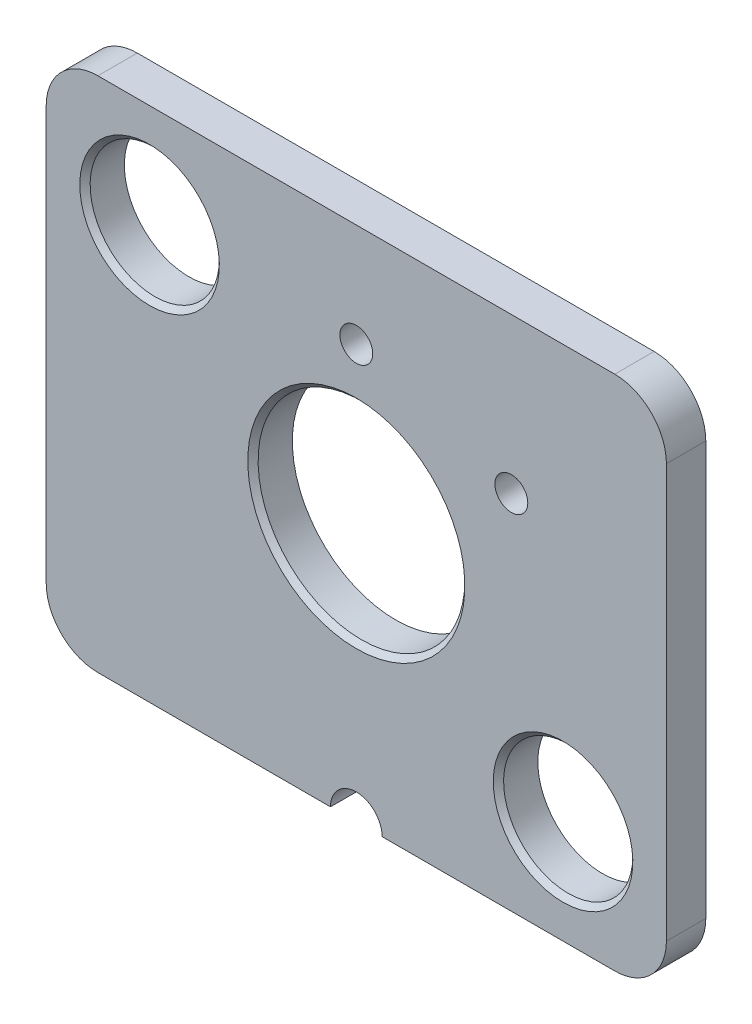
ISO-10303-21;
HEADER;
FILE_DESCRIPTION(('STEP AP214'),'2;1');
FILE_NAME('part.step','',(''),(''),'','','');
FILE_SCHEMA(('AUTOMOTIVE_DESIGN { 1 0 10303 214 1 1 1 1 }'));
ENDSEC;
DATA;
#1=APPLICATION_CONTEXT('core data for automotive mechanical design processes');
#2=APPLICATION_PROTOCOL_DEFINITION('international standard','automotive_design',2000,#1);
#3=PRODUCT_CONTEXT('',#1,'mechanical');
#4=PRODUCT('Part','Part','',(#3));
#5=PRODUCT_RELATED_PRODUCT_CATEGORY('part','',(#4));
#6=PRODUCT_DEFINITION_FORMATION('','',#4);
#7=PRODUCT_DEFINITION_CONTEXT('part definition',#1,'design');
#8=PRODUCT_DEFINITION('design','',#6,#7);
#9=PRODUCT_DEFINITION_SHAPE('','',#8);
#10=(LENGTH_UNIT() NAMED_UNIT(*) SI_UNIT(.MILLI.,.METRE.));
#11=(NAMED_UNIT(*) PLANE_ANGLE_UNIT() SI_UNIT($,.RADIAN.));
#12=(NAMED_UNIT(*) SI_UNIT($,.STERADIAN.) SOLID_ANGLE_UNIT());
#13=UNCERTAINTY_MEASURE_WITH_UNIT(LENGTH_MEASURE(1.E-05),#10,'distance_accuracy_value','');
#14=(GEOMETRIC_REPRESENTATION_CONTEXT(3) GLOBAL_UNCERTAINTY_ASSIGNED_CONTEXT((#13)) GLOBAL_UNIT_ASSIGNED_CONTEXT((#10,
#11,#12)) REPRESENTATION_CONTEXT('',''));
#15=CARTESIAN_POINT('',(0.,0.,0.));
#16=DIRECTION('',(0.,0.,1.));
#17=DIRECTION('',(1.,0.,0.));
#18=AXIS2_PLACEMENT_3D('',#15,#16,#17);
#19=CARTESIAN_POINT('',(10.,-8.,0.));
#20=DIRECTION('',(0.,0.,1.));
#21=DIRECTION('',(1.,0.,0.));
#22=AXIS2_PLACEMENT_3D('',#19,#20,#21);
#23=CYLINDRICAL_SURFACE('',#22,1.25);
#24=CARTESIAN_POINT('',(10.,-8.,0.));
#25=DIRECTION('',(0.,0.,1.));
#26=DIRECTION('',(1.,0.,0.));
#27=AXIS2_PLACEMENT_3D('',#24,#25,#26);
#28=CIRCLE('',#27,1.25);
#29=CARTESIAN_POINT('',(11.25,-8.,0.));
#30=VERTEX_POINT('',#29);
#31=EDGE_CURVE('E21',#30,#30,#28,.F.);
#32=ORIENTED_EDGE('',*,*,#31,.T.);
#33=EDGE_LOOP('',(#32));
#34=FACE_BOUND('',#33,.T.);
#35=CARTESIAN_POINT('',(10.,-8.,0.662000000000051));
#36=DIRECTION('',(0.,0.,1.));
#37=DIRECTION('',(1.,0.,0.));
#38=AXIS2_PLACEMENT_3D('',#35,#36,#37);
#39=CIRCLE('',#38,1.25);
#40=CARTESIAN_POINT('',(11.25,-8.,0.662));
#41=VERTEX_POINT('',#40);
#42=EDGE_CURVE('E112',#41,#41,#39,.F.);
#43=ORIENTED_EDGE('',*,*,#42,.F.);
#44=EDGE_LOOP('',(#43));
#45=FACE_BOUND('',#44,.T.);
#46=ADVANCED_FACE('F17',(#34,#45),#23,.F.);
#47=CARTESIAN_POINT('',(2.,-2.,0.));
#48=DIRECTION('',(0.,0.,1.));
#49=DIRECTION('',(1.,0.,0.));
#50=AXIS2_PLACEMENT_3D('',#47,#48,#49);
#51=CYLINDRICAL_SURFACE('',#50,1.25);
#52=CARTESIAN_POINT('',(2.,-2.,0.));
#53=DIRECTION('',(0.,0.,1.));
#54=DIRECTION('',(1.,0.,0.));
#55=AXIS2_PLACEMENT_3D('',#52,#53,#54);
#56=CIRCLE('',#55,1.25);
#57=CARTESIAN_POINT('',(3.25,-2.,0.));
#58=VERTEX_POINT('',#57);
#59=EDGE_CURVE('E104',#58,#58,#56,.F.);
#60=ORIENTED_EDGE('',*,*,#59,.T.);
#61=EDGE_LOOP('',(#60));
#62=FACE_BOUND('',#61,.T.);
#63=CARTESIAN_POINT('',(2.,-2.,0.662000000000051));
#64=DIRECTION('',(0.,0.,1.));
#65=DIRECTION('',(1.,0.,0.));
#66=AXIS2_PLACEMENT_3D('',#63,#64,#65);
#67=CIRCLE('',#66,1.25);
#68=CARTESIAN_POINT('',(3.25,-2.,0.662));
#69=VERTEX_POINT('',#68);
#70=EDGE_CURVE('E154',#69,#69,#67,.F.);
#71=ORIENTED_EDGE('',*,*,#70,.F.);
#72=EDGE_LOOP('',(#71));
#73=FACE_BOUND('',#72,.T.);
#74=ADVANCED_FACE('F214',(#62,#73),#51,.F.);
#75=CARTESIAN_POINT('',(0.,-10.,0.));
#76=DIRECTION('',(0.,0.,1.));
#77=DIRECTION('',(1.,0.,0.));
#78=AXIS2_PLACEMENT_3D('',#75,#76,#77);
#79=PLANE('',#78);
#80=CARTESIAN_POINT('',(6.,-5.,0.));
#81=DIRECTION('',(0.,0.,1.));
#82=DIRECTION('',(1.,0.,0.));
#83=AXIS2_PLACEMENT_3D('',#80,#81,#82);
#84=CIRCLE('',#83,2.);
#85=CARTESIAN_POINT('',(8.,-5.,0.));
#86=VERTEX_POINT('',#85);
#87=EDGE_CURVE('E191',#86,#86,#84,.F.);
#88=ORIENTED_EDGE('',*,*,#87,.F.);
#89=EDGE_LOOP('',(#88));
#90=FACE_BOUND('',#89,.T.);
#91=ORIENTED_EDGE('',*,*,#59,.F.);
#92=EDGE_LOOP('',(#91));
#93=FACE_BOUND('',#92,.T.);
#94=ORIENTED_EDGE('',*,*,#31,.F.);
#95=EDGE_LOOP('',(#94));
#96=FACE_BOUND('',#95,.T.);
#97=CARTESIAN_POINT('',(6.,-2.,0.));
#98=DIRECTION('',(0.,0.,1.));
#99=DIRECTION('',(1.,0.,0.));
#100=AXIS2_PLACEMENT_3D('',#97,#98,#99);
#101=CIRCLE('',#100,0.317499999999999);
#102=CARTESIAN_POINT('',(6.3175,-2.,0.));
#103=VERTEX_POINT('',#102);
#104=EDGE_CURVE('E194',#103,#103,#101,.F.);
#105=ORIENTED_EDGE('',*,*,#104,.F.);
#106=EDGE_LOOP('',(#105));
#107=FACE_BOUND('',#106,.T.);
#108=CARTESIAN_POINT('',(9.,-3.,0.));
#109=DIRECTION('',(0.,0.,1.));
#110=DIRECTION('',(1.,0.,0.));
#111=AXIS2_PLACEMENT_3D('',#108,#109,#110);
#112=CIRCLE('',#111,0.3175);
#113=CARTESIAN_POINT('',(9.3175,-3.,0.));
#114=VERTEX_POINT('',#113);
#115=EDGE_CURVE('E157',#114,#114,#112,.F.);
#116=ORIENTED_EDGE('',*,*,#115,.F.);
#117=EDGE_LOOP('',(#116));
#118=FACE_BOUND('',#117,.T.);
#119=CARTESIAN_POINT('',(6.,-10.,0.));
#120=DIRECTION('',(0.,0.,1.));
#121=DIRECTION('',(1.,0.,0.));
#122=AXIS2_PLACEMENT_3D('',#119,#120,#121);
#123=CIRCLE('',#122,0.5);
#124=CARTESIAN_POINT('',(5.5,-10.,0.));
#125=VERTEX_POINT('',#124);
#126=CARTESIAN_POINT('',(6.5,-10.,0.));
#127=VERTEX_POINT('',#126);
#128=EDGE_CURVE('E93',#125,#127,#123,.F.);
#129=ORIENTED_EDGE('',*,*,#128,.F.);
#130=DIRECTION('',(-1.,0.,0.));
#131=VECTOR('',#130,1.);
#132=CARTESIAN_POINT('',(3.25,-10.,0.));
#133=LINE('',#132,#131);
#134=CARTESIAN_POINT('',(1.,-10.,0.));
#135=VERTEX_POINT('',#134);
#136=EDGE_CURVE('E97',#125,#135,#133,.T.);
#137=ORIENTED_EDGE('',*,*,#136,.T.);
#138=CARTESIAN_POINT('',(1.,-9.,0.));
#139=DIRECTION('',(0.,0.,-1.));
#140=DIRECTION('',(0.,1.,0.));
#141=AXIS2_PLACEMENT_3D('',#138,#139,#140);
#142=CIRCLE('',#141,1.);
#143=CARTESIAN_POINT('',(0.,-9.00000000008979,0.));
#144=VERTEX_POINT('',#143);
#145=EDGE_CURVE('E124',#135,#144,#142,.T.);
#146=ORIENTED_EDGE('',*,*,#145,.T.);
#147=DIRECTION('',(0.,1.,0.));
#148=VECTOR('',#147,1.);
#149=CARTESIAN_POINT('',(0.,-5.,0.));
#150=LINE('',#149,#148);
#151=CARTESIAN_POINT('',(0.,-1.,0.));
#152=VERTEX_POINT('',#151);
#153=EDGE_CURVE('E128',#144,#152,#150,.T.);
#154=ORIENTED_EDGE('',*,*,#153,.T.);
#155=CARTESIAN_POINT('',(1.,-1.,0.));
#156=DIRECTION('',(0.,0.,-1.));
#157=DIRECTION('',(0.,1.,0.));
#158=AXIS2_PLACEMENT_3D('',#155,#156,#157);
#159=CIRCLE('',#158,1.);
#160=CARTESIAN_POINT('',(1.00000000010255,0.,0.));
#161=VERTEX_POINT('',#160);
#162=EDGE_CURVE('E132',#152,#161,#159,.T.);
#163=ORIENTED_EDGE('',*,*,#162,.T.);
#164=DIRECTION('',(1.,0.,0.));
#165=VECTOR('',#164,1.);
#166=CARTESIAN_POINT('',(6.,0.,0.));
#167=LINE('',#166,#165);
#168=CARTESIAN_POINT('',(11.,0.,0.));
#169=VERTEX_POINT('',#168);
#170=EDGE_CURVE('E136',#161,#169,#167,.T.);
#171=ORIENTED_EDGE('',*,*,#170,.T.);
#172=CARTESIAN_POINT('',(11.,-1.,0.));
#173=DIRECTION('',(0.,0.,-1.));
#174=DIRECTION('',(0.,1.,0.));
#175=AXIS2_PLACEMENT_3D('',#172,#173,#174);
#176=CIRCLE('',#175,0.999999999999999);
#177=CARTESIAN_POINT('',(12.,-1.0000000002051,0.));
#178=VERTEX_POINT('',#177);
#179=EDGE_CURVE('E140',#169,#178,#176,.T.);
#180=ORIENTED_EDGE('',*,*,#179,.T.);
#181=DIRECTION('',(0.,-1.,0.));
#182=VECTOR('',#181,1.);
#183=CARTESIAN_POINT('',(12.,-5.,0.));
#184=LINE('',#183,#182);
#185=CARTESIAN_POINT('',(12.,-9.,0.));
#186=VERTEX_POINT('',#185);
#187=EDGE_CURVE('E144',#178,#186,#184,.T.);
#188=ORIENTED_EDGE('',*,*,#187,.T.);
#189=CARTESIAN_POINT('',(11.,-9.,0.));
#190=DIRECTION('',(0.,0.,-1.));
#191=DIRECTION('',(0.,1.,0.));
#192=AXIS2_PLACEMENT_3D('',#189,#190,#191);
#193=CIRCLE('',#192,0.999999999999999);
#194=CARTESIAN_POINT('',(11.0000000001923,-10.,0.));
#195=VERTEX_POINT('',#194);
#196=EDGE_CURVE('E148',#186,#195,#193,.T.);
#197=ORIENTED_EDGE('',*,*,#196,.T.);
#198=DIRECTION('',(-1.,0.,0.));
#199=VECTOR('',#198,1.);
#200=CARTESIAN_POINT('',(8.75,-10.,0.));
#201=LINE('',#200,#199);
#202=EDGE_CURVE('E99',#195,#127,#201,.T.);
#203=ORIENTED_EDGE('',*,*,#202,.T.);
#204=EDGE_LOOP('',(#129,#137,#146,#154,#163,#171,#180,#188,#197,#203));
#205=FACE_BOUND('',#204,.T.);
#206=ADVANCED_FACE('F95',(#90,#93,#96,#107,#118,#205),#79,.F.);
#207=CARTESIAN_POINT('',(6.,-10.,0.));
#208=DIRECTION('',(0.,0.,1.));
#209=DIRECTION('',(1.,0.,0.));
#210=AXIS2_PLACEMENT_3D('',#207,#208,#209);
#211=CYLINDRICAL_SURFACE('',#210,0.5);
#212=CARTESIAN_POINT('',(6.,-10.,0.762));
#213=DIRECTION('',(0.,0.,1.));
#214=DIRECTION('',(1.,0.,0.));
#215=AXIS2_PLACEMENT_3D('',#212,#213,#214);
#216=CIRCLE('',#215,0.5);
#217=CARTESIAN_POINT('',(5.5,-10.,0.762));
#218=VERTEX_POINT('',#217);
#219=CARTESIAN_POINT('',(6.5,-10.,0.762));
#220=VERTEX_POINT('',#219);
#221=EDGE_CURVE('E116',#218,#220,#216,.F.);
#222=ORIENTED_EDGE('',*,*,#221,.F.);
#223=DIRECTION('',(0.,0.,-1.));
#224=VECTOR('',#223,1.);
#225=CARTESIAN_POINT('',(5.5,-10.,0.381));
#226=LINE('',#225,#224);
#227=EDGE_CURVE('E110',#218,#125,#226,.T.);
#228=ORIENTED_EDGE('',*,*,#227,.T.);
#229=ORIENTED_EDGE('',*,*,#128,.T.);
#230=DIRECTION('',(0.,0.,1.));
#231=VECTOR('',#230,1.);
#232=CARTESIAN_POINT('',(6.5,-10.,0.381));
#233=LINE('',#232,#231);
#234=EDGE_CURVE('E149',#127,#220,#233,.T.);
#235=ORIENTED_EDGE('',*,*,#234,.T.);
#236=EDGE_LOOP('',(#222,#228,#229,#235));
#237=FACE_BOUND('',#236,.T.);
#238=ADVANCED_FACE('F115',(#237),#211,.F.);
#239=CARTESIAN_POINT('',(11.,-10.,0.));
#240=DIRECTION('',(0.,1.,0.));
#241=DIRECTION('',(-1.,0.,0.));
#242=AXIS2_PLACEMENT_3D('',#239,#240,#241);
#243=PLANE('',#242);
#244=ORIENTED_EDGE('',*,*,#234,.F.);
#245=ORIENTED_EDGE('',*,*,#202,.F.);
#246=DIRECTION('',(0.,0.,-1.));
#247=VECTOR('',#246,1.);
#248=CARTESIAN_POINT('',(11.0000000003847,-10.,0.381));
#249=LINE('',#248,#247);
#250=CARTESIAN_POINT('',(11.0000000001923,-10.,0.762));
#251=VERTEX_POINT('',#250);
#252=EDGE_CURVE('E145',#195,#251,#249,.F.);
#253=ORIENTED_EDGE('',*,*,#252,.T.);
#254=DIRECTION('',(1.,0.,0.));
#255=VECTOR('',#254,1.);
#256=CARTESIAN_POINT('',(6.,-10.,0.762));
#257=LINE('',#256,#255);
#258=EDGE_CURVE('E189',#220,#251,#257,.T.);
#259=ORIENTED_EDGE('',*,*,#258,.F.);
#260=EDGE_LOOP('',(#244,#245,#253,#259));
#261=FACE_BOUND('',#260,.T.);
#262=ADVANCED_FACE('F370',(#261),#243,.F.);
#263=CARTESIAN_POINT('',(11.,-9.,0.762));
#264=DIRECTION('',(0.,0.,-1.));
#265=DIRECTION('',(0.,1.,0.));
#266=AXIS2_PLACEMENT_3D('',#263,#264,#265);
#267=CYLINDRICAL_SURFACE('',#266,0.999999999999999);
#268=ORIENTED_EDGE('',*,*,#252,.F.);
#269=ORIENTED_EDGE('',*,*,#196,.F.);
#270=DIRECTION('',(0.,0.,1.));
#271=VECTOR('',#270,1.);
#272=CARTESIAN_POINT('',(12.,-9.,0.381));
#273=LINE('',#272,#271);
#274=CARTESIAN_POINT('',(12.,-9.,0.762));
#275=VERTEX_POINT('',#274);
#276=EDGE_CURVE('E141',#186,#275,#273,.T.);
#277=ORIENTED_EDGE('',*,*,#276,.T.);
#278=CARTESIAN_POINT('',(11.,-9.,0.762));
#279=DIRECTION('',(0.,0.,-1.));
#280=DIRECTION('',(0.,1.,0.));
#281=AXIS2_PLACEMENT_3D('',#278,#279,#280);
#282=CIRCLE('',#281,0.999999999999999);
#283=EDGE_CURVE('E187',#251,#275,#282,.F.);
#284=ORIENTED_EDGE('',*,*,#283,.F.);
#285=EDGE_LOOP('',(#268,#269,#277,#284));
#286=FACE_BOUND('',#285,.T.);
#287=ADVANCED_FACE('F361',(#286),#267,.T.);
#288=CARTESIAN_POINT('',(12.,-9.,0.));
#289=DIRECTION('',(-1.,0.,0.));
#290=DIRECTION('',(0.,0.,1.));
#291=AXIS2_PLACEMENT_3D('',#288,#289,#290);
#292=PLANE('',#291);
#293=ORIENTED_EDGE('',*,*,#276,.F.);
#294=ORIENTED_EDGE('',*,*,#187,.F.);
#295=DIRECTION('',(0.,0.,-1.));
#296=VECTOR('',#295,1.);
#297=CARTESIAN_POINT('',(12.,-1.00000000041021,0.381));
#298=LINE('',#297,#296);
#299=CARTESIAN_POINT('',(12.,-1.0000000002051,0.762));
#300=VERTEX_POINT('',#299);
#301=EDGE_CURVE('E137',#178,#300,#298,.F.);
#302=ORIENTED_EDGE('',*,*,#301,.T.);
#303=DIRECTION('',(0.,1.,0.));
#304=VECTOR('',#303,1.);
#305=CARTESIAN_POINT('',(12.,-5.,0.762));
#306=LINE('',#305,#304);
#307=EDGE_CURVE('E186',#275,#300,#306,.T.);
#308=ORIENTED_EDGE('',*,*,#307,.F.);
#309=EDGE_LOOP('',(#293,#294,#302,#308));
#310=FACE_BOUND('',#309,.T.);
#311=ADVANCED_FACE('F352',(#310),#292,.F.);
#312=CARTESIAN_POINT('',(11.,-1.,0.762));
#313=DIRECTION('',(0.,0.,-1.));
#314=DIRECTION('',(0.,1.,0.));
#315=AXIS2_PLACEMENT_3D('',#312,#313,#314);
#316=CYLINDRICAL_SURFACE('',#315,0.999999999999999);
#317=ORIENTED_EDGE('',*,*,#301,.F.);
#318=ORIENTED_EDGE('',*,*,#179,.F.);
#319=DIRECTION('',(0.,0.,1.));
#320=VECTOR('',#319,1.);
#321=CARTESIAN_POINT('',(11.,0.,0.381));
#322=LINE('',#321,#320);
#323=CARTESIAN_POINT('',(11.,0.,0.762));
#324=VERTEX_POINT('',#323);
#325=EDGE_CURVE('E133',#169,#324,#322,.T.);
#326=ORIENTED_EDGE('',*,*,#325,.T.);
#327=CARTESIAN_POINT('',(11.,-1.,0.762));
#328=DIRECTION('',(0.,0.,-1.));
#329=DIRECTION('',(0.,1.,0.));
#330=AXIS2_PLACEMENT_3D('',#327,#328,#329);
#331=CIRCLE('',#330,0.999999999999999);
#332=EDGE_CURVE('E184',#300,#324,#331,.F.);
#333=ORIENTED_EDGE('',*,*,#332,.F.);
#334=EDGE_LOOP('',(#317,#318,#326,#333));
#335=FACE_BOUND('',#334,.T.);
#336=ADVANCED_FACE('F343',(#335),#316,.T.);
#337=CARTESIAN_POINT('',(1.,0.,0.762));
#338=DIRECTION('',(0.,-1.,0.));
#339=DIRECTION('',(0.,0.,-1.));
#340=AXIS2_PLACEMENT_3D('',#337,#338,#339);
#341=PLANE('',#340);
#342=ORIENTED_EDGE('',*,*,#325,.F.);
#343=ORIENTED_EDGE('',*,*,#170,.F.);
#344=DIRECTION('',(0.,0.,-1.));
#345=VECTOR('',#344,1.);
#346=CARTESIAN_POINT('',(1.0000000002051,0.,0.381));
#347=LINE('',#346,#345);
#348=CARTESIAN_POINT('',(1.00000000010255,0.,0.762));
#349=VERTEX_POINT('',#348);
#350=EDGE_CURVE('E129',#161,#349,#347,.F.);
#351=ORIENTED_EDGE('',*,*,#350,.T.);
#352=DIRECTION('',(-1.,0.,0.));
#353=VECTOR('',#352,1.);
#354=CARTESIAN_POINT('',(6.,0.,0.762));
#355=LINE('',#354,#353);
#356=EDGE_CURVE('E183',#324,#349,#355,.T.);
#357=ORIENTED_EDGE('',*,*,#356,.F.);
#358=EDGE_LOOP('',(#342,#343,#351,#357));
#359=FACE_BOUND('',#358,.T.);
#360=ADVANCED_FACE('F334',(#359),#341,.F.);
#361=CARTESIAN_POINT('',(1.,-1.,0.762));
#362=DIRECTION('',(0.,0.,-1.));
#363=DIRECTION('',(0.,1.,0.));
#364=AXIS2_PLACEMENT_3D('',#361,#362,#363);
#365=CYLINDRICAL_SURFACE('',#364,1.);
#366=ORIENTED_EDGE('',*,*,#350,.F.);
#367=ORIENTED_EDGE('',*,*,#162,.F.);
#368=DIRECTION('',(0.,0.,1.));
#369=VECTOR('',#368,1.);
#370=CARTESIAN_POINT('',(0.,-1.,0.381));
#371=LINE('',#370,#369);
#372=CARTESIAN_POINT('',(0.,-1.,0.762));
#373=VERTEX_POINT('',#372);
#374=EDGE_CURVE('E125',#152,#373,#371,.T.);
#375=ORIENTED_EDGE('',*,*,#374,.T.);
#376=CARTESIAN_POINT('',(1.,-1.,0.762));
#377=DIRECTION('',(0.,0.,-1.));
#378=DIRECTION('',(0.,1.,0.));
#379=AXIS2_PLACEMENT_3D('',#376,#377,#378);
#380=CIRCLE('',#379,1.);
#381=EDGE_CURVE('E181',#349,#373,#380,.F.);
#382=ORIENTED_EDGE('',*,*,#381,.F.);
#383=EDGE_LOOP('',(#366,#367,#375,#382));
#384=FACE_BOUND('',#383,.T.);
#385=ADVANCED_FACE('F325',(#384),#365,.T.);
#386=CARTESIAN_POINT('',(0.,-9.,0.));
#387=DIRECTION('',(1.,0.,0.));
#388=DIRECTION('',(0.,1.,0.));
#389=AXIS2_PLACEMENT_3D('',#386,#387,#388);
#390=PLANE('',#389);
#391=DIRECTION('',(0.,0.,-1.));
#392=VECTOR('',#391,1.);
#393=CARTESIAN_POINT('',(0.,-9.00000000017959,0.381));
#394=LINE('',#393,#392);
#395=CARTESIAN_POINT('',(0.,-9.00000000008979,0.762));
#396=VERTEX_POINT('',#395);
#397=EDGE_CURVE('E118',#144,#396,#394,.F.);
#398=ORIENTED_EDGE('',*,*,#397,.T.);
#399=DIRECTION('',(0.,-1.,0.));
#400=VECTOR('',#399,1.);
#401=CARTESIAN_POINT('',(0.,-5.,0.762));
#402=LINE('',#401,#400);
#403=EDGE_CURVE('E180',#373,#396,#402,.T.);
#404=ORIENTED_EDGE('',*,*,#403,.F.);
#405=ORIENTED_EDGE('',*,*,#374,.F.);
#406=ORIENTED_EDGE('',*,*,#153,.F.);
#407=EDGE_LOOP('',(#398,#404,#405,#406));
#408=FACE_BOUND('',#407,.T.);
#409=ADVANCED_FACE('F316',(#408),#390,.F.);
#410=CARTESIAN_POINT('',(1.,-9.,0.762));
#411=DIRECTION('',(0.,0.,-1.));
#412=DIRECTION('',(0.,1.,0.));
#413=AXIS2_PLACEMENT_3D('',#410,#411,#412);
#414=CYLINDRICAL_SURFACE('',#413,1.);
#415=ORIENTED_EDGE('',*,*,#397,.F.);
#416=ORIENTED_EDGE('',*,*,#145,.F.);
#417=DIRECTION('',(0.,0.,1.));
#418=VECTOR('',#417,1.);
#419=CARTESIAN_POINT('',(1.,-10.,0.381));
#420=LINE('',#419,#418);
#421=CARTESIAN_POINT('',(1.,-10.,0.762));
#422=VERTEX_POINT('',#421);
#423=EDGE_CURVE('E111',#135,#422,#420,.T.);
#424=ORIENTED_EDGE('',*,*,#423,.T.);
#425=CARTESIAN_POINT('',(1.,-9.,0.762));
#426=DIRECTION('',(0.,0.,-1.));
#427=DIRECTION('',(0.,1.,0.));
#428=AXIS2_PLACEMENT_3D('',#425,#426,#427);
#429=CIRCLE('',#428,1.);
#430=EDGE_CURVE('E36',#396,#422,#429,.F.);
#431=ORIENTED_EDGE('',*,*,#430,.F.);
#432=EDGE_LOOP('',(#415,#416,#424,#431));
#433=FACE_BOUND('',#432,.T.);
#434=ADVANCED_FACE('F308',(#433),#414,.T.);
#435=CARTESIAN_POINT('',(5.5,-10.,0.));
#436=DIRECTION('',(0.,1.,0.));
#437=DIRECTION('',(-1.,0.,0.));
#438=AXIS2_PLACEMENT_3D('',#435,#436,#437);
#439=PLANE('',#438);
#440=ORIENTED_EDGE('',*,*,#227,.F.);
#441=DIRECTION('',(1.,0.,0.));
#442=VECTOR('',#441,1.);
#443=CARTESIAN_POINT('',(6.,-10.,0.762));
#444=LINE('',#443,#442);
#445=EDGE_CURVE('E178',#422,#218,#444,.T.);
#446=ORIENTED_EDGE('',*,*,#445,.F.);
#447=ORIENTED_EDGE('',*,*,#423,.F.);
#448=ORIENTED_EDGE('',*,*,#136,.F.);
#449=EDGE_LOOP('',(#440,#446,#447,#448));
#450=FACE_BOUND('',#449,.T.);
#451=ADVANCED_FACE('F108',(#450),#439,.F.);
#452=CARTESIAN_POINT('',(10.,-8.,0.662));
#453=DIRECTION('',(0.,0.,1.));
#454=DIRECTION('',(0.,-1.,0.));
#455=AXIS2_PLACEMENT_3D('',#452,#453,#454);
#456=CONICAL_SURFACE('',#455,1.25,0.785398163397463);
#457=ORIENTED_EDGE('',*,*,#42,.T.);
#458=EDGE_LOOP('',(#457));
#459=FACE_BOUND('',#458,.T.);
#460=CARTESIAN_POINT('',(10.,-8.,0.76200000000004));
#461=DIRECTION('',(0.,0.,1.));
#462=DIRECTION('',(0.,-1.,0.));
#463=AXIS2_PLACEMENT_3D('',#460,#461,#462);
#464=CIRCLE('',#463,1.35000000000004);
#465=CARTESIAN_POINT('',(10.,-9.35000000000004,0.76200000000004));
#466=VERTEX_POINT('',#465);
#467=EDGE_CURVE('E175',#466,#466,#464,.F.);
#468=ORIENTED_EDGE('',*,*,#467,.F.);
#469=EDGE_LOOP('',(#468));
#470=FACE_BOUND('',#469,.T.);
#471=ADVANCED_FACE('F235',(#459,#470),#456,.F.);
#472=CARTESIAN_POINT('',(2.,-2.,0.662));
#473=DIRECTION('',(0.,0.,1.));
#474=DIRECTION('',(0.,-1.,0.));
#475=AXIS2_PLACEMENT_3D('',#472,#473,#474);
#476=CONICAL_SURFACE('',#475,1.25,0.785398163397446);
#477=ORIENTED_EDGE('',*,*,#70,.T.);
#478=EDGE_LOOP('',(#477));
#479=FACE_BOUND('',#478,.T.);
#480=CARTESIAN_POINT('',(2.,-2.,0.76200000000004));
#481=DIRECTION('',(0.,0.,1.));
#482=DIRECTION('',(0.,-1.,0.));
#483=AXIS2_PLACEMENT_3D('',#480,#481,#482);
#484=CIRCLE('',#483,1.35000000000004);
#485=CARTESIAN_POINT('',(2.,-3.35000000000004,0.762000000000041));
#486=VERTEX_POINT('',#485);
#487=EDGE_CURVE('E172',#486,#486,#484,.F.);
#488=ORIENTED_EDGE('',*,*,#487,.F.);
#489=EDGE_LOOP('',(#488));
#490=FACE_BOUND('',#489,.T.);
#491=ADVANCED_FACE('F224',(#479,#490),#476,.F.);
#492=CARTESIAN_POINT('',(9.,-3.,0.));
#493=DIRECTION('',(0.,0.,1.));
#494=DIRECTION('',(1.,0.,0.));
#495=AXIS2_PLACEMENT_3D('',#492,#493,#494);
#496=CYLINDRICAL_SURFACE('',#495,0.3175);
#497=CARTESIAN_POINT('',(9.,-3.,0.762));
#498=DIRECTION('',(0.,0.,1.));
#499=DIRECTION('',(1.,0.,0.));
#500=AXIS2_PLACEMENT_3D('',#497,#498,#499);
#501=CIRCLE('',#500,0.3175);
#502=CARTESIAN_POINT('',(9.3175,-3.,0.762));
#503=VERTEX_POINT('',#502);
#504=EDGE_CURVE('E169',#503,#503,#501,.F.);
#505=ORIENTED_EDGE('',*,*,#504,.F.);
#506=EDGE_LOOP('',(#505));
#507=FACE_BOUND('',#506,.T.);
#508=ORIENTED_EDGE('',*,*,#115,.T.);
#509=EDGE_LOOP('',(#508));
#510=FACE_BOUND('',#509,.T.);
#511=ADVANCED_FACE('F221',(#507,#510),#496,.F.);
#512=CARTESIAN_POINT('',(6.,-2.,0.));
#513=DIRECTION('',(0.,0.,1.));
#514=DIRECTION('',(1.,0.,0.));
#515=AXIS2_PLACEMENT_3D('',#512,#513,#514);
#516=CYLINDRICAL_SURFACE('',#515,0.317499999999999);
#517=CARTESIAN_POINT('',(6.,-2.,0.762));
#518=DIRECTION('',(0.,0.,1.));
#519=DIRECTION('',(1.,0.,0.));
#520=AXIS2_PLACEMENT_3D('',#517,#518,#519);
#521=CIRCLE('',#520,0.317499999999999);
#522=CARTESIAN_POINT('',(6.3175,-2.,0.762));
#523=VERTEX_POINT('',#522);
#524=EDGE_CURVE('E153',#523,#523,#521,.F.);
#525=ORIENTED_EDGE('',*,*,#524,.F.);
#526=EDGE_LOOP('',(#525));
#527=FACE_BOUND('',#526,.T.);
#528=ORIENTED_EDGE('',*,*,#104,.T.);
#529=EDGE_LOOP('',(#528));
#530=FACE_BOUND('',#529,.T.);
#531=ADVANCED_FACE('F223',(#527,#530),#516,.F.);
#532=CARTESIAN_POINT('',(6.,-5.,0.));
#533=DIRECTION('',(0.,0.,1.));
#534=DIRECTION('',(1.,0.,0.));
#535=AXIS2_PLACEMENT_3D('',#532,#533,#534);
#536=CYLINDRICAL_SURFACE('',#535,2.);
#537=ORIENTED_EDGE('',*,*,#87,.T.);
#538=EDGE_LOOP('',(#537));
#539=FACE_BOUND('',#538,.T.);
#540=CARTESIAN_POINT('',(6.,-5.,0.662000000000051));
#541=DIRECTION('',(0.,0.,1.));
#542=DIRECTION('',(1.,0.,0.));
#543=AXIS2_PLACEMENT_3D('',#540,#541,#542);
#544=CIRCLE('',#543,2.);
#545=CARTESIAN_POINT('',(8.,-5.,0.662));
#546=VERTEX_POINT('',#545);
#547=EDGE_CURVE('E27',#546,#546,#544,.F.);
#548=ORIENTED_EDGE('',*,*,#547,.F.);
#549=EDGE_LOOP('',(#548));
#550=FACE_BOUND('',#549,.T.);
#551=ADVANCED_FACE('F232',(#539,#550),#536,.F.);
#552=CARTESIAN_POINT('',(0.,-10.,0.762));
#553=DIRECTION('',(0.,0.,1.));
#554=DIRECTION('',(1.,0.,0.));
#555=AXIS2_PLACEMENT_3D('',#552,#553,#554);
#556=PLANE('',#555);
#557=ORIENTED_EDGE('',*,*,#524,.T.);
#558=EDGE_LOOP('',(#557));
#559=FACE_BOUND('',#558,.T.);
#560=ORIENTED_EDGE('',*,*,#504,.T.);
#561=EDGE_LOOP('',(#560));
#562=FACE_BOUND('',#561,.T.);
#563=CARTESIAN_POINT('',(6.,-5.,0.76200000000004));
#564=DIRECTION('',(0.,0.,1.));
#565=DIRECTION('',(0.,-1.,0.));
#566=AXIS2_PLACEMENT_3D('',#563,#564,#565);
#567=CIRCLE('',#566,2.10000000000004);
#568=CARTESIAN_POINT('',(6.,-7.10000000000004,0.762000000000041));
#569=VERTEX_POINT('',#568);
#570=EDGE_CURVE('E11',#569,#569,#567,.T.);
#571=ORIENTED_EDGE('',*,*,#570,.F.);
#572=EDGE_LOOP('',(#571));
#573=FACE_BOUND('',#572,.T.);
#574=ORIENTED_EDGE('',*,*,#487,.T.);
#575=EDGE_LOOP('',(#574));
#576=FACE_BOUND('',#575,.T.);
#577=ORIENTED_EDGE('',*,*,#467,.T.);
#578=EDGE_LOOP('',(#577));
#579=FACE_BOUND('',#578,.T.);
#580=ORIENTED_EDGE('',*,*,#430,.T.);
#581=ORIENTED_EDGE('',*,*,#445,.T.);
#582=ORIENTED_EDGE('',*,*,#221,.T.);
#583=ORIENTED_EDGE('',*,*,#258,.T.);
#584=ORIENTED_EDGE('',*,*,#283,.T.);
#585=ORIENTED_EDGE('',*,*,#307,.T.);
#586=ORIENTED_EDGE('',*,*,#332,.T.);
#587=ORIENTED_EDGE('',*,*,#356,.T.);
#588=ORIENTED_EDGE('',*,*,#381,.T.);
#589=ORIENTED_EDGE('',*,*,#403,.T.);
#590=EDGE_LOOP('',(#580,#581,#582,#583,#584,#585,#586,#587,#588,#589));
#591=FACE_BOUND('',#590,.T.);
#592=ADVANCED_FACE('F19',(#559,#562,#573,#576,#579,#591),#556,.T.);
#593=CARTESIAN_POINT('',(6.,-5.,0.662));
#594=DIRECTION('',(0.,0.,1.));
#595=DIRECTION('',(0.,-1.,0.));
#596=AXIS2_PLACEMENT_3D('',#593,#594,#595);
#597=CONICAL_SURFACE('',#596,2.,0.785398163397446);
#598=ORIENTED_EDGE('',*,*,#547,.T.);
#599=EDGE_LOOP('',(#598));
#600=FACE_BOUND('',#599,.T.);
#601=ORIENTED_EDGE('',*,*,#570,.T.);
#602=EDGE_LOOP('',(#601));
#603=FACE_BOUND('',#602,.T.);
#604=ADVANCED_FACE('F239',(#600,#603),#597,.F.);
#605=CLOSED_SHELL('',(#46,#74,#206,#238,#262,#287,#311,#336,#360,#385,#409,#434,#451,#471,#491,
#511,#531,#551,#592,#604));
#606=MANIFOLD_SOLID_BREP('B1',#605);
#607=ADVANCED_BREP_SHAPE_REPRESENTATION('',(#18,#606),#14);
#608=SHAPE_DEFINITION_REPRESENTATION(#9,#607);
ENDSEC;
END-ISO-10303-21;
